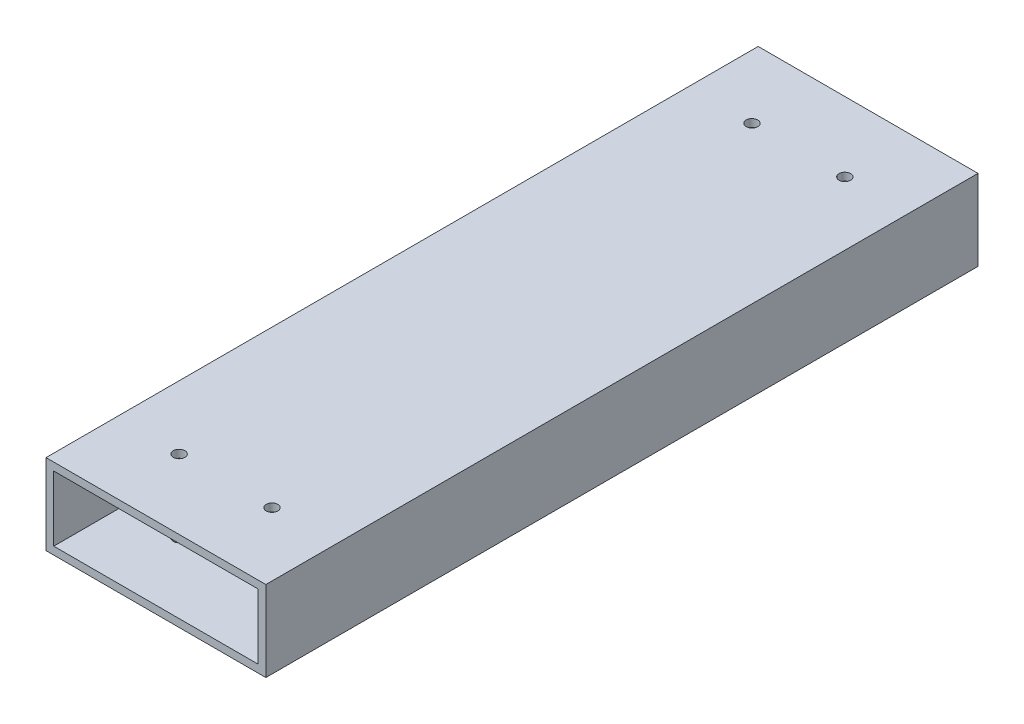
ISO-10303-21;
HEADER;
FILE_DESCRIPTION(('STEP AP214'),'2;1');
FILE_NAME('part.step','',(''),(''),'','','');
FILE_SCHEMA(('AUTOMOTIVE_DESIGN { 1 0 10303 214 1 1 1 1 }'));
ENDSEC;
DATA;
#1=APPLICATION_CONTEXT('core data for automotive mechanical design processes');
#2=APPLICATION_PROTOCOL_DEFINITION('international standard','automotive_design',2000,#1);
#3=PRODUCT_CONTEXT('',#1,'mechanical');
#4=PRODUCT('Part','Part','',(#3));
#5=PRODUCT_RELATED_PRODUCT_CATEGORY('part','',(#4));
#6=PRODUCT_DEFINITION_FORMATION('','',#4);
#7=PRODUCT_DEFINITION_CONTEXT('part definition',#1,'design');
#8=PRODUCT_DEFINITION('design','',#6,#7);
#9=PRODUCT_DEFINITION_SHAPE('','',#8);
#10=(LENGTH_UNIT() NAMED_UNIT(*) SI_UNIT(.MILLI.,.METRE.));
#11=(NAMED_UNIT(*) PLANE_ANGLE_UNIT() SI_UNIT($,.RADIAN.));
#12=(NAMED_UNIT(*) SI_UNIT($,.STERADIAN.) SOLID_ANGLE_UNIT());
#13=UNCERTAINTY_MEASURE_WITH_UNIT(LENGTH_MEASURE(1.E-05),#10,'distance_accuracy_value','');
#14=(GEOMETRIC_REPRESENTATION_CONTEXT(3) GLOBAL_UNCERTAINTY_ASSIGNED_CONTEXT((#13)) GLOBAL_UNIT_ASSIGNED_CONTEXT((#10,
#11,#12)) REPRESENTATION_CONTEXT('',''));
#15=CARTESIAN_POINT('',(0.,0.,0.));
#16=DIRECTION('',(0.,0.,1.));
#17=DIRECTION('',(1.,0.,0.));
#18=AXIS2_PLACEMENT_3D('',#15,#16,#17);
#19=CARTESIAN_POINT('',(37.1384884769841,-197.063772130399,184.));
#20=DIRECTION('',(-0.999999999999999,0.,0.));
#21=DIRECTION('',(0.,-1.,0.));
#22=AXIS2_PLACEMENT_3D('',#19,#20,#21);
#23=PLANE('',#22);
#24=DIRECTION('',(0.,1.,0.));
#25=VECTOR('',#24,1.);
#26=CARTESIAN_POINT('',(37.138488476984,-197.063772130399,1.66533453693773E-13));
#27=LINE('',#26,#25);
#28=CARTESIAN_POINT('',(37.1384884769842,-217.883772130399,1.38777878078145E-13));
#29=VERTEX_POINT('',#28);
#30=CARTESIAN_POINT('',(37.138488476984,-197.063772130399,1.66533453693773E-13));
#31=VERTEX_POINT('',#30);
#32=EDGE_CURVE('E134',#29,#31,#27,.T.);
#33=ORIENTED_EDGE('',*,*,#32,.T.);
#34=DIRECTION('',(0.,0.,-0.999999999999999));
#35=VECTOR('',#34,1.);
#36=CARTESIAN_POINT('',(37.1384884769841,-197.063772130399,184.));
#37=LINE('',#36,#35);
#38=CARTESIAN_POINT('',(37.1384884769841,-197.063772130399,184.));
#39=VERTEX_POINT('',#38);
#40=EDGE_CURVE('E11',#39,#31,#37,.T.);
#41=ORIENTED_EDGE('',*,*,#40,.F.);
#42=DIRECTION('',(0.,1.,0.));
#43=VECTOR('',#42,1.);
#44=CARTESIAN_POINT('',(37.1384884769841,-197.063772130399,184.));
#45=LINE('',#44,#43);
#46=CARTESIAN_POINT('',(37.1384884769843,-217.883772130399,184.));
#47=VERTEX_POINT('',#46);
#48=EDGE_CURVE('E136',#47,#39,#45,.T.);
#49=ORIENTED_EDGE('',*,*,#48,.F.);
#50=DIRECTION('',(0.,0.,-0.999999999999999));
#51=VECTOR('',#50,1.);
#52=CARTESIAN_POINT('',(37.1384884769843,-217.883772130399,184.));
#53=LINE('',#52,#51);
#54=EDGE_CURVE('E146',#47,#29,#53,.T.);
#55=ORIENTED_EDGE('',*,*,#54,.T.);
#56=EDGE_LOOP('',(#33,#41,#49,#55));
#57=FACE_BOUND('',#56,.T.);
#58=ADVANCED_FACE('F38',(#57),#23,.F.);
#59=CARTESIAN_POINT('',(37.1384884769841,-197.063772130399,184.));
#60=DIRECTION('',(0.,-1.,0.));
#61=DIRECTION('',(0.,0.,-0.999999999999999));
#62=AXIS2_PLACEMENT_3D('',#59,#60,#61);
#63=PLANE('',#62);
#64=CARTESIAN_POINT('',(20.7384884769842,-197.063772130399,18.0000000000002));
#65=DIRECTION('',(0.,1.,0.));
#66=DIRECTION('',(0.,0.,0.999999999999999));
#67=AXIS2_PLACEMENT_3D('',#64,#65,#66);
#68=CIRCLE('',#67,1.5);
#69=CARTESIAN_POINT('',(20.7384884769842,-197.063772130399,19.5000000000002));
#70=VERTEX_POINT('',#69);
#71=EDGE_CURVE('E260',#70,#70,#68,.T.);
#72=ORIENTED_EDGE('',*,*,#71,.F.);
#73=EDGE_LOOP('',(#72));
#74=FACE_BOUND('',#73,.T.);
#75=CARTESIAN_POINT('',(-3.26151152301588,-197.063772130398,166.));
#76=DIRECTION('',(0.,1.,0.));
#77=DIRECTION('',(0.,0.,0.999999999999999));
#78=AXIS2_PLACEMENT_3D('',#75,#76,#77);
#79=CIRCLE('',#78,1.5);
#80=CARTESIAN_POINT('',(-3.26151152301588,-197.063772130398,167.5));
#81=VERTEX_POINT('',#80);
#82=EDGE_CURVE('E261',#81,#81,#79,.T.);
#83=ORIENTED_EDGE('',*,*,#82,.F.);
#84=EDGE_LOOP('',(#83));
#85=FACE_BOUND('',#84,.T.);
#86=CARTESIAN_POINT('',(20.7384884769841,-197.063772130399,166.));
#87=DIRECTION('',(0.,1.,0.));
#88=DIRECTION('',(0.,0.,0.999999999999999));
#89=AXIS2_PLACEMENT_3D('',#86,#87,#88);
#90=CIRCLE('',#89,1.5);
#91=CARTESIAN_POINT('',(20.7384884769841,-197.063772130399,167.5));
#92=VERTEX_POINT('',#91);
#93=EDGE_CURVE('E264',#92,#92,#90,.T.);
#94=ORIENTED_EDGE('',*,*,#93,.F.);
#95=EDGE_LOOP('',(#94));
#96=FACE_BOUND('',#95,.T.);
#97=CARTESIAN_POINT('',(-3.26151152301571,-197.063772130398,18.0000000000002));
#98=DIRECTION('',(0.,1.,0.));
#99=DIRECTION('',(0.,0.,0.999999999999999));
#100=AXIS2_PLACEMENT_3D('',#97,#98,#99);
#101=CIRCLE('',#100,1.5);
#102=CARTESIAN_POINT('',(-3.26151152301571,-197.063772130398,19.5000000000002));
#103=VERTEX_POINT('',#102);
#104=EDGE_CURVE('E165',#103,#103,#101,.T.);
#105=ORIENTED_EDGE('',*,*,#104,.F.);
#106=EDGE_LOOP('',(#105));
#107=FACE_BOUND('',#106,.T.);
#108=DIRECTION('',(-1.,0.,0.));
#109=VECTOR('',#108,1.);
#110=CARTESIAN_POINT('',(37.138488476984,-197.063772130399,1.66533453693773E-13));
#111=LINE('',#110,#109);
#112=CARTESIAN_POINT('',(-19.6615115230159,-197.063772130399,2.77555756156289E-13));
#113=VERTEX_POINT('',#112);
#114=EDGE_CURVE('E149',#31,#113,#111,.T.);
#115=ORIENTED_EDGE('',*,*,#114,.T.);
#116=DIRECTION('',(0.,0.,-0.999999999999999));
#117=VECTOR('',#116,1.);
#118=CARTESIAN_POINT('',(-19.6615115230159,-197.063772130399,184.));
#119=LINE('',#118,#117);
#120=CARTESIAN_POINT('',(-19.6615115230159,-197.063772130399,184.));
#121=VERTEX_POINT('',#120);
#122=EDGE_CURVE('E46',#121,#113,#119,.T.);
#123=ORIENTED_EDGE('',*,*,#122,.F.);
#124=DIRECTION('',(-1.,0.,0.));
#125=VECTOR('',#124,1.);
#126=CARTESIAN_POINT('',(37.1384884769841,-197.063772130399,184.));
#127=LINE('',#126,#125);
#128=EDGE_CURVE('E139',#39,#121,#127,.T.);
#129=ORIENTED_EDGE('',*,*,#128,.F.);
#130=ORIENTED_EDGE('',*,*,#40,.T.);
#131=EDGE_LOOP('',(#115,#123,#129,#130));
#132=FACE_BOUND('',#131,.T.);
#133=ADVANCED_FACE('F218',(#74,#85,#96,#107,#132),#63,.F.);
#134=CARTESIAN_POINT('',(-19.6615115230159,-197.063772130399,184.));
#135=DIRECTION('',(1.,0.,0.));
#136=DIRECTION('',(0.,0.,-0.999999999999999));
#137=AXIS2_PLACEMENT_3D('',#134,#135,#136);
#138=PLANE('',#137);
#139=DIRECTION('',(0.,-1.,0.));
#140=VECTOR('',#139,1.);
#141=CARTESIAN_POINT('',(-19.6615115230159,-197.063772130399,2.77555756156289E-13));
#142=LINE('',#141,#140);
#143=CARTESIAN_POINT('',(-19.6615115230159,-217.883772130399,2.22044604925031E-13));
#144=VERTEX_POINT('',#143);
#145=EDGE_CURVE('E151',#113,#144,#142,.T.);
#146=ORIENTED_EDGE('',*,*,#145,.T.);
#147=DIRECTION('',(0.,0.,-0.999999999999999));
#148=VECTOR('',#147,1.);
#149=CARTESIAN_POINT('',(-19.6615115230159,-217.883772130399,184.));
#150=LINE('',#149,#148);
#151=CARTESIAN_POINT('',(-19.6615115230159,-217.883772130399,184.));
#152=VERTEX_POINT('',#151);
#153=EDGE_CURVE('E156',#152,#144,#150,.T.);
#154=ORIENTED_EDGE('',*,*,#153,.F.);
#155=DIRECTION('',(0.,-1.,0.));
#156=VECTOR('',#155,1.);
#157=CARTESIAN_POINT('',(-19.6615115230159,-197.063772130399,184.));
#158=LINE('',#157,#156);
#159=EDGE_CURVE('E142',#121,#152,#158,.T.);
#160=ORIENTED_EDGE('',*,*,#159,.F.);
#161=ORIENTED_EDGE('',*,*,#122,.T.);
#162=EDGE_LOOP('',(#146,#154,#160,#161));
#163=FACE_BOUND('',#162,.T.);
#164=ADVANCED_FACE('F223',(#163),#138,.F.);
#165=CARTESIAN_POINT('',(37.1384884769843,-217.883772130399,184.));
#166=DIRECTION('',(0.,1.,0.));
#167=DIRECTION('',(0.,0.,0.999999999999999));
#168=AXIS2_PLACEMENT_3D('',#165,#166,#167);
#169=PLANE('',#168);
#170=CARTESIAN_POINT('',(20.7384884769842,-217.883772130399,18.0000000000001));
#171=DIRECTION('',(0.,1.,0.));
#172=DIRECTION('',(0.,0.,0.999999999999999));
#173=AXIS2_PLACEMENT_3D('',#170,#171,#172);
#174=CIRCLE('',#173,1.5);
#175=CARTESIAN_POINT('',(20.7384884769842,-217.883772130399,19.5000000000001));
#176=VERTEX_POINT('',#175);
#177=EDGE_CURVE('E192',#176,#176,#174,.T.);
#178=ORIENTED_EDGE('',*,*,#177,.T.);
#179=EDGE_LOOP('',(#178));
#180=FACE_BOUND('',#179,.T.);
#181=CARTESIAN_POINT('',(-3.26151152301579,-217.883772130398,166.));
#182=DIRECTION('',(0.,1.,0.));
#183=DIRECTION('',(0.,0.,0.999999999999999));
#184=AXIS2_PLACEMENT_3D('',#181,#182,#183);
#185=CIRCLE('',#184,1.5);
#186=CARTESIAN_POINT('',(-3.26151152301579,-217.883772130398,167.5));
#187=VERTEX_POINT('',#186);
#188=EDGE_CURVE('E177',#187,#187,#185,.T.);
#189=ORIENTED_EDGE('',*,*,#188,.T.);
#190=EDGE_LOOP('',(#189));
#191=FACE_BOUND('',#190,.T.);
#192=CARTESIAN_POINT('',(20.7384884769841,-217.883772130399,166.));
#193=DIRECTION('',(0.,1.,0.));
#194=DIRECTION('',(0.,0.,0.999999999999999));
#195=AXIS2_PLACEMENT_3D('',#192,#193,#194);
#196=CIRCLE('',#195,1.5);
#197=CARTESIAN_POINT('',(20.7384884769841,-217.883772130399,167.5));
#198=VERTEX_POINT('',#197);
#199=EDGE_CURVE('E173',#198,#198,#196,.T.);
#200=ORIENTED_EDGE('',*,*,#199,.T.);
#201=EDGE_LOOP('',(#200));
#202=FACE_BOUND('',#201,.T.);
#203=CARTESIAN_POINT('',(-3.26151152301579,-217.883772130398,18.0000000000001));
#204=DIRECTION('',(0.,1.,0.));
#205=DIRECTION('',(0.,0.,0.999999999999999));
#206=AXIS2_PLACEMENT_3D('',#203,#204,#205);
#207=CIRCLE('',#206,1.5);
#208=CARTESIAN_POINT('',(-3.26151152301579,-217.883772130398,19.5000000000001));
#209=VERTEX_POINT('',#208);
#210=EDGE_CURVE('E169',#209,#209,#207,.T.);
#211=ORIENTED_EDGE('',*,*,#210,.T.);
#212=EDGE_LOOP('',(#211));
#213=FACE_BOUND('',#212,.T.);
#214=DIRECTION('',(1.,0.,0.));
#215=VECTOR('',#214,1.);
#216=CARTESIAN_POINT('',(37.1384884769842,-217.883772130399,1.38777878078145E-13));
#217=LINE('',#216,#215);
#218=EDGE_CURVE('E140',#144,#29,#217,.T.);
#219=ORIENTED_EDGE('',*,*,#218,.T.);
#220=ORIENTED_EDGE('',*,*,#54,.F.);
#221=DIRECTION('',(1.,0.,0.));
#222=VECTOR('',#221,1.);
#223=CARTESIAN_POINT('',(37.1384884769843,-217.883772130399,184.));
#224=LINE('',#223,#222);
#225=EDGE_CURVE('E144',#152,#47,#224,.T.);
#226=ORIENTED_EDGE('',*,*,#225,.F.);
#227=ORIENTED_EDGE('',*,*,#153,.T.);
#228=EDGE_LOOP('',(#219,#220,#226,#227));
#229=FACE_BOUND('',#228,.T.);
#230=ADVANCED_FACE('F208',(#180,#191,#202,#213,#229),#169,.F.);
#231=CARTESIAN_POINT('',(2.08166817117217E-13,-1.94289029309402E-13,184.));
#232=DIRECTION('',(0.,0.,-0.999999999999999));
#233=DIRECTION('',(-1.,0.,0.));
#234=AXIS2_PLACEMENT_3D('',#231,#232,#233);
#235=PLANE('',#234);
#236=DIRECTION('',(1.,0.,0.));
#237=VECTOR('',#236,1.);
#238=CARTESIAN_POINT('',(35.1384884769842,-215.883772130399,184.));
#239=LINE('',#238,#237);
#240=CARTESIAN_POINT('',(-17.661511523016,-215.883772130399,184.));
#241=VERTEX_POINT('',#240);
#242=CARTESIAN_POINT('',(35.1384884769842,-215.883772130399,184.));
#243=VERTEX_POINT('',#242);
#244=EDGE_CURVE('E196',#241,#243,#239,.T.);
#245=ORIENTED_EDGE('',*,*,#244,.F.);
#246=DIRECTION('',(0.,-1.,0.));
#247=VECTOR('',#246,1.);
#248=CARTESIAN_POINT('',(-17.661511523016,-199.063772130399,184.));
#249=LINE('',#248,#247);
#250=CARTESIAN_POINT('',(-17.661511523016,-199.063772130399,184.));
#251=VERTEX_POINT('',#250);
#252=EDGE_CURVE('E135',#251,#241,#249,.T.);
#253=ORIENTED_EDGE('',*,*,#252,.F.);
#254=DIRECTION('',(-1.,0.,0.));
#255=VECTOR('',#254,1.);
#256=CARTESIAN_POINT('',(35.1384884769839,-199.063772130399,184.));
#257=LINE('',#256,#255);
#258=CARTESIAN_POINT('',(35.1384884769839,-199.063772130399,184.));
#259=VERTEX_POINT('',#258);
#260=EDGE_CURVE('E132',#259,#251,#257,.T.);
#261=ORIENTED_EDGE('',*,*,#260,.F.);
#262=DIRECTION('',(0.,1.,0.));
#263=VECTOR('',#262,1.);
#264=CARTESIAN_POINT('',(35.1384884769839,-199.063772130399,184.));
#265=LINE('',#264,#263);
#266=EDGE_CURVE('E110',#243,#259,#265,.T.);
#267=ORIENTED_EDGE('',*,*,#266,.F.);
#268=EDGE_LOOP('',(#245,#253,#261,#267));
#269=FACE_BOUND('',#268,.T.);
#270=ORIENTED_EDGE('',*,*,#48,.T.);
#271=ORIENTED_EDGE('',*,*,#128,.T.);
#272=ORIENTED_EDGE('',*,*,#159,.T.);
#273=ORIENTED_EDGE('',*,*,#225,.T.);
#274=EDGE_LOOP('',(#270,#271,#272,#273));
#275=FACE_BOUND('',#274,.T.);
#276=ADVANCED_FACE('F205',(#269,#275),#235,.F.);
#277=CARTESIAN_POINT('',(0.,0.,0.));
#278=DIRECTION('',(0.,0.,-0.999999999999999));
#279=DIRECTION('',(-1.,0.,0.));
#280=AXIS2_PLACEMENT_3D('',#277,#278,#279);
#281=PLANE('',#280);
#282=DIRECTION('',(0.,1.,0.));
#283=VECTOR('',#282,1.);
#284=CARTESIAN_POINT('',(-17.6615115230159,-199.063772130399,1.94289029309402E-13));
#285=LINE('',#284,#283);
#286=CARTESIAN_POINT('',(-17.6615115230158,-215.883772130399,0.));
#287=VERTEX_POINT('',#286);
#288=CARTESIAN_POINT('',(-17.6615115230159,-199.063772130399,1.94289029309402E-13));
#289=VERTEX_POINT('',#288);
#290=EDGE_CURVE('E62',#287,#289,#285,.T.);
#291=ORIENTED_EDGE('',*,*,#290,.F.);
#292=DIRECTION('',(-1.,0.,0.));
#293=VECTOR('',#292,1.);
#294=CARTESIAN_POINT('',(35.1384884769841,-215.883772130399,1.66533453693773E-13));
#295=LINE('',#294,#293);
#296=CARTESIAN_POINT('',(35.1384884769841,-215.883772130399,1.66533453693773E-13));
#297=VERTEX_POINT('',#296);
#298=EDGE_CURVE('E123',#297,#287,#295,.T.);
#299=ORIENTED_EDGE('',*,*,#298,.F.);
#300=DIRECTION('',(0.,-1.,0.));
#301=VECTOR('',#300,1.);
#302=CARTESIAN_POINT('',(35.138488476984,-199.063772130399,3.05311331771918E-13));
#303=LINE('',#302,#301);
#304=CARTESIAN_POINT('',(35.138488476984,-199.063772130399,3.05311331771918E-13));
#305=VERTEX_POINT('',#304);
#306=EDGE_CURVE('E107',#305,#297,#303,.T.);
#307=ORIENTED_EDGE('',*,*,#306,.F.);
#308=DIRECTION('',(1.,0.,0.));
#309=VECTOR('',#308,1.);
#310=CARTESIAN_POINT('',(35.138488476984,-199.063772130399,3.05311331771918E-13));
#311=LINE('',#310,#309);
#312=EDGE_CURVE('E116',#289,#305,#311,.T.);
#313=ORIENTED_EDGE('',*,*,#312,.F.);
#314=EDGE_LOOP('',(#291,#299,#307,#313));
#315=FACE_BOUND('',#314,.T.);
#316=ORIENTED_EDGE('',*,*,#32,.F.);
#317=ORIENTED_EDGE('',*,*,#218,.F.);
#318=ORIENTED_EDGE('',*,*,#145,.F.);
#319=ORIENTED_EDGE('',*,*,#114,.F.);
#320=EDGE_LOOP('',(#316,#317,#318,#319));
#321=FACE_BOUND('',#320,.T.);
#322=ADVANCED_FACE('F120',(#315,#321),#281,.T.);
#323=CARTESIAN_POINT('',(-17.661511523016,-199.063772130399,239.414369977471));
#324=DIRECTION('',(-1.,0.,0.));
#325=DIRECTION('',(0.,0.,0.999999999999999));
#326=AXIS2_PLACEMENT_3D('',#323,#324,#325);
#327=PLANE('',#326);
#328=ORIENTED_EDGE('',*,*,#252,.T.);
#329=DIRECTION('',(0.,0.,-0.999999999999999));
#330=VECTOR('',#329,1.);
#331=CARTESIAN_POINT('',(-17.6615115230159,-215.883772130399,239.414369977471));
#332=LINE('',#331,#330);
#333=EDGE_CURVE('E128',#241,#287,#332,.T.);
#334=ORIENTED_EDGE('',*,*,#333,.T.);
#335=ORIENTED_EDGE('',*,*,#290,.T.);
#336=DIRECTION('',(0.,0.,-0.999999999999999));
#337=VECTOR('',#336,1.);
#338=CARTESIAN_POINT('',(-17.661511523016,-199.063772130399,239.414369977471));
#339=LINE('',#338,#337);
#340=EDGE_CURVE('E113',#251,#289,#339,.T.);
#341=ORIENTED_EDGE('',*,*,#340,.F.);
#342=EDGE_LOOP('',(#328,#334,#335,#341));
#343=FACE_BOUND('',#342,.T.);
#344=ADVANCED_FACE('F200',(#343),#327,.F.);
#345=CARTESIAN_POINT('',(35.138488476984,-215.883772130399,239.414369977471));
#346=DIRECTION('',(0.,-1.,0.));
#347=DIRECTION('',(0.,0.,-0.999999999999999));
#348=AXIS2_PLACEMENT_3D('',#345,#346,#347);
#349=PLANE('',#348);
#350=CARTESIAN_POINT('',(20.7384884769842,-215.883772130399,18.0000000000002));
#351=DIRECTION('',(0.,-1.,0.));
#352=DIRECTION('',(0.,0.,-0.999999999999999));
#353=AXIS2_PLACEMENT_3D('',#350,#351,#352);
#354=CIRCLE('',#353,1.5);
#355=CARTESIAN_POINT('',(20.7384884769842,-215.883772130399,16.5000000000002));
#356=VERTEX_POINT('',#355);
#357=EDGE_CURVE('E189',#356,#356,#354,.T.);
#358=ORIENTED_EDGE('',*,*,#357,.T.);
#359=EDGE_LOOP('',(#358));
#360=FACE_BOUND('',#359,.T.);
#361=CARTESIAN_POINT('',(-3.26151152301576,-215.883772130399,166.));
#362=DIRECTION('',(0.,-1.,0.));
#363=DIRECTION('',(0.,0.,-0.999999999999999));
#364=AXIS2_PLACEMENT_3D('',#361,#362,#363);
#365=CIRCLE('',#364,1.5);
#366=CARTESIAN_POINT('',(-3.26151152301576,-215.883772130399,164.5));
#367=VERTEX_POINT('',#366);
#368=EDGE_CURVE('E172',#367,#367,#365,.T.);
#369=ORIENTED_EDGE('',*,*,#368,.T.);
#370=EDGE_LOOP('',(#369));
#371=FACE_BOUND('',#370,.T.);
#372=CARTESIAN_POINT('',(20.7384884769842,-215.883772130399,166.));
#373=DIRECTION('',(0.,-1.,0.));
#374=DIRECTION('',(0.,0.,-0.999999999999999));
#375=AXIS2_PLACEMENT_3D('',#372,#373,#374);
#376=CIRCLE('',#375,1.5);
#377=CARTESIAN_POINT('',(20.7384884769842,-215.883772130399,164.5));
#378=VERTEX_POINT('',#377);
#379=EDGE_CURVE('E168',#378,#378,#376,.T.);
#380=ORIENTED_EDGE('',*,*,#379,.T.);
#381=EDGE_LOOP('',(#380));
#382=FACE_BOUND('',#381,.T.);
#383=CARTESIAN_POINT('',(-3.26151152301581,-215.883772130398,18.0000000000004));
#384=DIRECTION('',(0.,-1.,0.));
#385=DIRECTION('',(0.,0.,-0.999999999999999));
#386=AXIS2_PLACEMENT_3D('',#383,#384,#385);
#387=CIRCLE('',#386,1.5);
#388=CARTESIAN_POINT('',(-3.26151152301581,-215.883772130398,16.5000000000004));
#389=VERTEX_POINT('',#388);
#390=EDGE_CURVE('E164',#389,#389,#387,.T.);
#391=ORIENTED_EDGE('',*,*,#390,.T.);
#392=EDGE_LOOP('',(#391));
#393=FACE_BOUND('',#392,.T.);
#394=ORIENTED_EDGE('',*,*,#244,.T.);
#395=DIRECTION('',(0.,0.,-0.999999999999999));
#396=VECTOR('',#395,1.);
#397=CARTESIAN_POINT('',(35.138488476984,-215.883772130399,239.414369977471));
#398=LINE('',#397,#396);
#399=EDGE_CURVE('E112',#243,#297,#398,.T.);
#400=ORIENTED_EDGE('',*,*,#399,.T.);
#401=ORIENTED_EDGE('',*,*,#298,.T.);
#402=ORIENTED_EDGE('',*,*,#333,.F.);
#403=EDGE_LOOP('',(#394,#400,#401,#402));
#404=FACE_BOUND('',#403,.T.);
#405=ADVANCED_FACE('F204',(#360,#371,#382,#393,#404),#349,.F.);
#406=CARTESIAN_POINT('',(35.1384884769839,-199.063772130399,239.414369977471));
#407=DIRECTION('',(1.,0.,0.));
#408=DIRECTION('',(0.,0.,-0.999999999999999));
#409=AXIS2_PLACEMENT_3D('',#406,#407,#408);
#410=PLANE('',#409);
#411=ORIENTED_EDGE('',*,*,#266,.T.);
#412=DIRECTION('',(0.,0.,-0.999999999999999));
#413=VECTOR('',#412,1.);
#414=CARTESIAN_POINT('',(35.1384884769839,-199.063772130399,239.414369977471));
#415=LINE('',#414,#413);
#416=EDGE_CURVE('E54',#259,#305,#415,.T.);
#417=ORIENTED_EDGE('',*,*,#416,.T.);
#418=ORIENTED_EDGE('',*,*,#306,.T.);
#419=ORIENTED_EDGE('',*,*,#399,.F.);
#420=EDGE_LOOP('',(#411,#417,#418,#419));
#421=FACE_BOUND('',#420,.T.);
#422=ADVANCED_FACE('F104',(#421),#410,.F.);
#423=CARTESIAN_POINT('',(35.1384884769839,-199.063772130399,239.414369977471));
#424=DIRECTION('',(0.,1.,0.));
#425=DIRECTION('',(0.,0.,0.999999999999999));
#426=AXIS2_PLACEMENT_3D('',#423,#424,#425);
#427=PLANE('',#426);
#428=CARTESIAN_POINT('',(20.738488476984,-199.063772130399,18.0000000000002));
#429=DIRECTION('',(0.,1.,0.));
#430=DIRECTION('',(0.,0.,0.999999999999999));
#431=AXIS2_PLACEMENT_3D('',#428,#429,#430);
#432=CIRCLE('',#431,1.5);
#433=CARTESIAN_POINT('',(20.738488476984,-199.063772130399,19.5000000000002));
#434=VERTEX_POINT('',#433);
#435=EDGE_CURVE('E41',#434,#434,#432,.T.);
#436=ORIENTED_EDGE('',*,*,#435,.T.);
#437=EDGE_LOOP('',(#436));
#438=FACE_BOUND('',#437,.T.);
#439=CARTESIAN_POINT('',(-3.26151152301582,-199.063772130399,166.));
#440=DIRECTION('',(0.,1.,0.));
#441=DIRECTION('',(0.,0.,0.999999999999999));
#442=AXIS2_PLACEMENT_3D('',#439,#440,#441);
#443=CIRCLE('',#442,1.5);
#444=CARTESIAN_POINT('',(-3.26151152301582,-199.063772130399,167.5));
#445=VERTEX_POINT('',#444);
#446=EDGE_CURVE('E170',#445,#445,#443,.T.);
#447=ORIENTED_EDGE('',*,*,#446,.T.);
#448=EDGE_LOOP('',(#447));
#449=FACE_BOUND('',#448,.T.);
#450=CARTESIAN_POINT('',(20.7384884769841,-199.063772130399,166.));
#451=DIRECTION('',(0.,1.,0.));
#452=DIRECTION('',(0.,0.,0.999999999999999));
#453=AXIS2_PLACEMENT_3D('',#450,#451,#452);
#454=CIRCLE('',#453,1.5);
#455=CARTESIAN_POINT('',(20.7384884769841,-199.063772130399,167.5));
#456=VERTEX_POINT('',#455);
#457=EDGE_CURVE('E166',#456,#456,#454,.T.);
#458=ORIENTED_EDGE('',*,*,#457,.T.);
#459=EDGE_LOOP('',(#458));
#460=FACE_BOUND('',#459,.T.);
#461=CARTESIAN_POINT('',(-3.26151152301597,-199.063772130399,18.0000000000002));
#462=DIRECTION('',(0.,1.,0.));
#463=DIRECTION('',(0.,0.,0.999999999999999));
#464=AXIS2_PLACEMENT_3D('',#461,#462,#463);
#465=CIRCLE('',#464,1.5);
#466=CARTESIAN_POINT('',(-3.26151152301597,-199.063772130399,19.5000000000002));
#467=VERTEX_POINT('',#466);
#468=EDGE_CURVE('E161',#467,#467,#465,.T.);
#469=ORIENTED_EDGE('',*,*,#468,.T.);
#470=EDGE_LOOP('',(#469));
#471=FACE_BOUND('',#470,.T.);
#472=ORIENTED_EDGE('',*,*,#260,.T.);
#473=ORIENTED_EDGE('',*,*,#340,.T.);
#474=ORIENTED_EDGE('',*,*,#312,.T.);
#475=ORIENTED_EDGE('',*,*,#416,.F.);
#476=EDGE_LOOP('',(#472,#473,#474,#475));
#477=FACE_BOUND('',#476,.T.);
#478=ADVANCED_FACE('F117',(#438,#449,#460,#471,#477),#427,.F.);
#479=CARTESIAN_POINT('',(-3.2615115230159,-223.063772130399,18.0000000000002));
#480=DIRECTION('',(0.,1.,0.));
#481=DIRECTION('',(0.,0.,0.999999999999999));
#482=AXIS2_PLACEMENT_3D('',#479,#480,#481);
#483=CYLINDRICAL_SURFACE('',#482,1.5);
#484=ORIENTED_EDGE('',*,*,#104,.T.);
#485=EDGE_LOOP('',(#484));
#486=FACE_BOUND('',#485,.T.);
#487=ORIENTED_EDGE('',*,*,#468,.F.);
#488=EDGE_LOOP('',(#487));
#489=FACE_BOUND('',#488,.T.);
#490=ADVANCED_FACE('F276',(#486,#489),#483,.F.);
#491=CARTESIAN_POINT('',(20.7384884769842,-223.063772130399,166.));
#492=DIRECTION('',(0.,1.,0.));
#493=DIRECTION('',(0.,0.,0.999999999999999));
#494=AXIS2_PLACEMENT_3D('',#491,#492,#493);
#495=CYLINDRICAL_SURFACE('',#494,1.5);
#496=ORIENTED_EDGE('',*,*,#93,.T.);
#497=EDGE_LOOP('',(#496));
#498=FACE_BOUND('',#497,.T.);
#499=ORIENTED_EDGE('',*,*,#457,.F.);
#500=EDGE_LOOP('',(#499));
#501=FACE_BOUND('',#500,.T.);
#502=ADVANCED_FACE('F270',(#498,#501),#495,.F.);
#503=CARTESIAN_POINT('',(-3.26151152301576,-223.063772130399,166.));
#504=DIRECTION('',(0.,1.,0.));
#505=DIRECTION('',(0.,0.,0.999999999999999));
#506=AXIS2_PLACEMENT_3D('',#503,#504,#505);
#507=CYLINDRICAL_SURFACE('',#506,1.5);
#508=ORIENTED_EDGE('',*,*,#82,.T.);
#509=EDGE_LOOP('',(#508));
#510=FACE_BOUND('',#509,.T.);
#511=ORIENTED_EDGE('',*,*,#446,.F.);
#512=EDGE_LOOP('',(#511));
#513=FACE_BOUND('',#512,.T.);
#514=ADVANCED_FACE('F304',(#510,#513),#507,.F.);
#515=CARTESIAN_POINT('',(20.7384884769841,-223.063772130399,18.));
#516=DIRECTION('',(0.,1.,0.));
#517=DIRECTION('',(0.,0.,0.999999999999999));
#518=AXIS2_PLACEMENT_3D('',#515,#516,#517);
#519=CYLINDRICAL_SURFACE('',#518,1.5);
#520=ORIENTED_EDGE('',*,*,#71,.T.);
#521=EDGE_LOOP('',(#520));
#522=FACE_BOUND('',#521,.T.);
#523=ORIENTED_EDGE('',*,*,#435,.F.);
#524=EDGE_LOOP('',(#523));
#525=FACE_BOUND('',#524,.T.);
#526=ADVANCED_FACE('F297',(#522,#525),#519,.F.);
#527=ORIENTED_EDGE('',*,*,#390,.F.);
#528=EDGE_LOOP('',(#527));
#529=FACE_BOUND('',#528,.T.);
#530=ORIENTED_EDGE('',*,*,#210,.F.);
#531=EDGE_LOOP('',(#530));
#532=FACE_BOUND('',#531,.T.);
#533=ADVANCED_FACE('F280',(#529,#532),#483,.F.);
#534=ORIENTED_EDGE('',*,*,#379,.F.);
#535=EDGE_LOOP('',(#534));
#536=FACE_BOUND('',#535,.T.);
#537=ORIENTED_EDGE('',*,*,#199,.F.);
#538=EDGE_LOOP('',(#537));
#539=FACE_BOUND('',#538,.T.);
#540=ADVANCED_FACE('F296',(#536,#539),#495,.F.);
#541=ORIENTED_EDGE('',*,*,#368,.F.);
#542=EDGE_LOOP('',(#541));
#543=FACE_BOUND('',#542,.T.);
#544=ORIENTED_EDGE('',*,*,#188,.F.);
#545=EDGE_LOOP('',(#544));
#546=FACE_BOUND('',#545,.T.);
#547=ADVANCED_FACE('F299',(#543,#546),#507,.F.);
#548=ORIENTED_EDGE('',*,*,#357,.F.);
#549=EDGE_LOOP('',(#548));
#550=FACE_BOUND('',#549,.T.);
#551=ORIENTED_EDGE('',*,*,#177,.F.);
#552=EDGE_LOOP('',(#551));
#553=FACE_BOUND('',#552,.T.);
#554=ADVANCED_FACE('F302',(#550,#553),#519,.F.);
#555=CLOSED_SHELL('',(#58,#133,#164,#230,#276,#322,#344,#405,#422,#478,#490,#502,#514,#526,#533,
#540,#547,#554));
#556=MANIFOLD_SOLID_BREP('B2',#555);
#557=ADVANCED_BREP_SHAPE_REPRESENTATION('',(#18,#556),#14);
#558=SHAPE_DEFINITION_REPRESENTATION(#9,#557);
ENDSEC;
END-ISO-10303-21;
